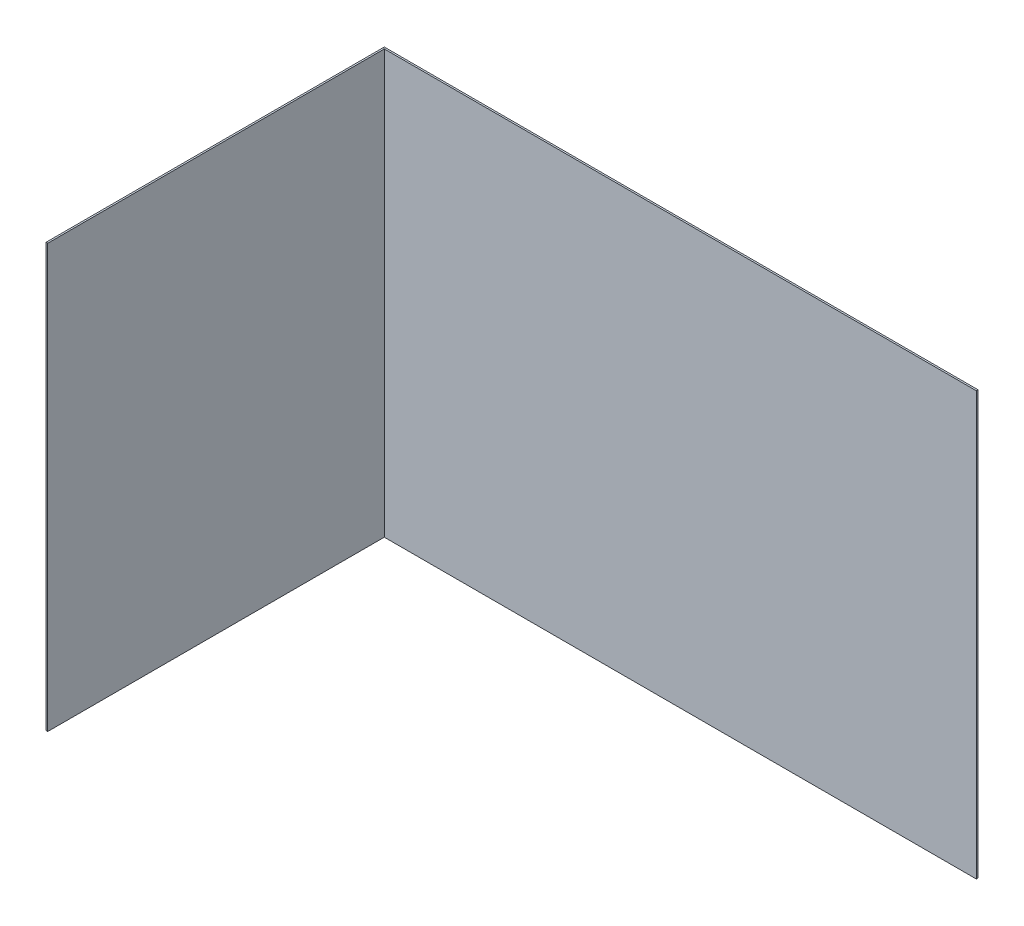
ISO-10303-21;
HEADER;
FILE_DESCRIPTION(('STEP AP214'),'2;1');
FILE_NAME('part.step','',(''),(''),'','','');
FILE_SCHEMA(('AUTOMOTIVE_DESIGN { 1 0 10303 214 1 1 1 1 }'));
ENDSEC;
DATA;
#1=APPLICATION_CONTEXT('core data for automotive mechanical design processes');
#2=APPLICATION_PROTOCOL_DEFINITION('international standard','automotive_design',2000,#1);
#3=PRODUCT_CONTEXT('',#1,'mechanical');
#4=PRODUCT('Part','Part','',(#3));
#5=PRODUCT_RELATED_PRODUCT_CATEGORY('part','',(#4));
#6=PRODUCT_DEFINITION_FORMATION('','',#4);
#7=PRODUCT_DEFINITION_CONTEXT('part definition',#1,'design');
#8=PRODUCT_DEFINITION('design','',#6,#7);
#9=PRODUCT_DEFINITION_SHAPE('','',#8);
#10=(LENGTH_UNIT() NAMED_UNIT(*) SI_UNIT(.MILLI.,.METRE.));
#11=(NAMED_UNIT(*) PLANE_ANGLE_UNIT() SI_UNIT($,.RADIAN.));
#12=(NAMED_UNIT(*) SI_UNIT($,.STERADIAN.) SOLID_ANGLE_UNIT());
#13=UNCERTAINTY_MEASURE_WITH_UNIT(LENGTH_MEASURE(1.E-05),#10,'distance_accuracy_value','');
#14=(GEOMETRIC_REPRESENTATION_CONTEXT(3) GLOBAL_UNCERTAINTY_ASSIGNED_CONTEXT((#13)) GLOBAL_UNIT_ASSIGNED_CONTEXT((#10,
#11,#12)) REPRESENTATION_CONTEXT('',''));
#15=CARTESIAN_POINT('',(0.,0.,0.));
#16=DIRECTION('',(0.,0.,1.));
#17=DIRECTION('',(1.,0.,0.));
#18=AXIS2_PLACEMENT_3D('',#15,#16,#17);
#19=CARTESIAN_POINT('',(-0.001,0.,0.));
#20=DIRECTION('',(1.,0.,0.));
#21=DIRECTION('',(0.,0.,1.));
#22=AXIS2_PLACEMENT_3D('',#19,#20,#21);
#23=PLANE('',#22);
#24=DIRECTION('',(0.,1.,0.));
#25=VECTOR('',#24,1.);
#26=CARTESIAN_POINT('',(-0.001,0.,0.2));
#27=LINE('',#26,#25);
#28=CARTESIAN_POINT('',(-0.001,0.,0.2));
#29=VERTEX_POINT('',#28);
#30=CARTESIAN_POINT('',(-0.001,0.25,0.2));
#31=VERTEX_POINT('',#30);
#32=EDGE_CURVE('E11',#29,#31,#27,.T.);
#33=ORIENTED_EDGE('',*,*,#32,.T.);
#34=DIRECTION('',(0.,0.,-1.));
#35=VECTOR('',#34,1.);
#36=CARTESIAN_POINT('',(-0.001,0.25,0.2));
#37=LINE('',#36,#35);
#38=CARTESIAN_POINT('',(-0.001,0.25,0.001));
#39=VERTEX_POINT('',#38);
#40=EDGE_CURVE('E98',#31,#39,#37,.T.);
#41=ORIENTED_EDGE('',*,*,#40,.T.);
#42=DIRECTION('',(0.,-1.,0.));
#43=VECTOR('',#42,1.);
#44=CARTESIAN_POINT('',(-0.001,0.25,0.001));
#45=LINE('',#44,#43);
#46=CARTESIAN_POINT('',(-0.001,0.,0.001));
#47=VERTEX_POINT('',#46);
#48=EDGE_CURVE('E100',#39,#47,#45,.T.);
#49=ORIENTED_EDGE('',*,*,#48,.T.);
#50=DIRECTION('',(0.,0.,1.));
#51=VECTOR('',#50,1.);
#52=CARTESIAN_POINT('',(-0.001,0.,0.));
#53=LINE('',#52,#51);
#54=EDGE_CURVE('E116',#47,#29,#53,.T.);
#55=ORIENTED_EDGE('',*,*,#54,.T.);
#56=EDGE_LOOP('',(#33,#41,#49,#55));
#57=FACE_BOUND('',#56,.T.);
#58=ADVANCED_FACE('F17',(#57),#23,.F.);
#59=CARTESIAN_POINT('',(0.,0.,0.2));
#60=DIRECTION('',(0.,0.,-1.));
#61=DIRECTION('',(0.,-1.,0.));
#62=AXIS2_PLACEMENT_3D('',#59,#60,#61);
#63=PLANE('',#62);
#64=DIRECTION('',(0.,1.,0.));
#65=VECTOR('',#64,1.);
#66=CARTESIAN_POINT('',(0.,0.,0.2));
#67=LINE('',#66,#65);
#68=CARTESIAN_POINT('',(0.,0.,0.2));
#69=VERTEX_POINT('',#68);
#70=CARTESIAN_POINT('',(0.,0.25,0.2));
#71=VERTEX_POINT('',#70);
#72=EDGE_CURVE('E150',#69,#71,#67,.T.);
#73=ORIENTED_EDGE('',*,*,#72,.T.);
#74=DIRECTION('',(-1.,0.,0.));
#75=VECTOR('',#74,1.);
#76=CARTESIAN_POINT('',(0.,0.25,0.2));
#77=LINE('',#76,#75);
#78=EDGE_CURVE('E26',#71,#31,#77,.T.);
#79=ORIENTED_EDGE('',*,*,#78,.T.);
#80=ORIENTED_EDGE('',*,*,#32,.F.);
#81=DIRECTION('',(-1.,0.,0.));
#82=VECTOR('',#81,1.);
#83=CARTESIAN_POINT('',(0.,0.,0.2));
#84=LINE('',#83,#82);
#85=EDGE_CURVE('E154',#69,#29,#84,.T.);
#86=ORIENTED_EDGE('',*,*,#85,.F.);
#87=EDGE_LOOP('',(#73,#79,#80,#86));
#88=FACE_BOUND('',#87,.T.);
#89=ADVANCED_FACE('F19',(#88),#63,.F.);
#90=CARTESIAN_POINT('',(0.,0.25,0.2));
#91=DIRECTION('',(0.,-1.,0.));
#92=DIRECTION('',(0.,0.,-1.));
#93=AXIS2_PLACEMENT_3D('',#90,#91,#92);
#94=PLANE('',#93);
#95=DIRECTION('',(-1.,0.,0.));
#96=VECTOR('',#95,1.);
#97=CARTESIAN_POINT('',(0.35,0.25,0.001));
#98=LINE('',#97,#96);
#99=CARTESIAN_POINT('',(0.,0.25,0.001));
#100=VERTEX_POINT('',#99);
#101=EDGE_CURVE('E119',#100,#39,#98,.T.);
#102=ORIENTED_EDGE('',*,*,#101,.T.);
#103=ORIENTED_EDGE('',*,*,#40,.F.);
#104=ORIENTED_EDGE('',*,*,#78,.F.);
#105=DIRECTION('',(0.,0.,-1.));
#106=VECTOR('',#105,1.);
#107=CARTESIAN_POINT('',(0.,0.25,0.2));
#108=LINE('',#107,#106);
#109=EDGE_CURVE('E122',#71,#100,#108,.T.);
#110=ORIENTED_EDGE('',*,*,#109,.T.);
#111=EDGE_LOOP('',(#102,#103,#104,#110));
#112=FACE_BOUND('',#111,.T.);
#113=ADVANCED_FACE('F120',(#112),#94,.F.);
#114=CARTESIAN_POINT('',(-0.001,0.25,0.));
#115=DIRECTION('',(1.,0.,0.));
#116=DIRECTION('',(0.,1.,0.));
#117=AXIS2_PLACEMENT_3D('',#114,#115,#116);
#118=PLANE('',#117);
#119=DIRECTION('',(0.,-1.,0.));
#120=VECTOR('',#119,1.);
#121=CARTESIAN_POINT('',(-0.001,0.25,0.));
#122=LINE('',#121,#120);
#123=CARTESIAN_POINT('',(-0.001,0.25,0.));
#124=VERTEX_POINT('',#123);
#125=CARTESIAN_POINT('',(-0.001,0.,0.));
#126=VERTEX_POINT('',#125);
#127=EDGE_CURVE('E127',#124,#126,#122,.T.);
#128=ORIENTED_EDGE('',*,*,#127,.T.);
#129=DIRECTION('',(0.,0.,1.));
#130=VECTOR('',#129,1.);
#131=CARTESIAN_POINT('',(-0.001,0.,0.));
#132=LINE('',#131,#130);
#133=EDGE_CURVE('E113',#126,#47,#132,.T.);
#134=ORIENTED_EDGE('',*,*,#133,.T.);
#135=ORIENTED_EDGE('',*,*,#48,.F.);
#136=DIRECTION('',(0.,0.,1.));
#137=VECTOR('',#136,1.);
#138=CARTESIAN_POINT('',(-0.001,0.25,0.));
#139=LINE('',#138,#137);
#140=EDGE_CURVE('E110',#124,#39,#139,.T.);
#141=ORIENTED_EDGE('',*,*,#140,.F.);
#142=EDGE_LOOP('',(#128,#134,#135,#141));
#143=FACE_BOUND('',#142,.T.);
#144=ADVANCED_FACE('F108',(#143),#118,.F.);
#145=CARTESIAN_POINT('',(0.,0.,0.));
#146=DIRECTION('',(0.,1.,0.));
#147=DIRECTION('',(1.,0.,0.));
#148=AXIS2_PLACEMENT_3D('',#145,#146,#147);
#149=PLANE('',#148);
#150=ORIENTED_EDGE('',*,*,#85,.T.);
#151=ORIENTED_EDGE('',*,*,#54,.F.);
#152=DIRECTION('',(1.,0.,0.));
#153=VECTOR('',#152,1.);
#154=CARTESIAN_POINT('',(-0.001,0.,0.001));
#155=LINE('',#154,#153);
#156=CARTESIAN_POINT('',(0.,0.,0.001));
#157=VERTEX_POINT('',#156);
#158=EDGE_CURVE('E173',#47,#157,#155,.T.);
#159=ORIENTED_EDGE('',*,*,#158,.T.);
#160=DIRECTION('',(0.,0.,1.));
#161=VECTOR('',#160,1.);
#162=CARTESIAN_POINT('',(0.,0.,0.));
#163=LINE('',#162,#161);
#164=EDGE_CURVE('E144',#157,#69,#163,.T.);
#165=ORIENTED_EDGE('',*,*,#164,.T.);
#166=EDGE_LOOP('',(#150,#151,#159,#165));
#167=FACE_BOUND('',#166,.T.);
#168=ADVANCED_FACE('F302',(#167),#149,.F.);
#169=CARTESIAN_POINT('',(0.,0.,0.));
#170=DIRECTION('',(1.,0.,0.));
#171=DIRECTION('',(0.,0.,1.));
#172=AXIS2_PLACEMENT_3D('',#169,#170,#171);
#173=PLANE('',#172);
#174=ORIENTED_EDGE('',*,*,#164,.F.);
#175=DIRECTION('',(0.,-1.,0.));
#176=VECTOR('',#175,1.);
#177=CARTESIAN_POINT('',(0.,0.,0.001));
#178=LINE('',#177,#176);
#179=EDGE_CURVE('E167',#100,#157,#178,.T.);
#180=ORIENTED_EDGE('',*,*,#179,.F.);
#181=ORIENTED_EDGE('',*,*,#109,.F.);
#182=ORIENTED_EDGE('',*,*,#72,.F.);
#183=EDGE_LOOP('',(#174,#180,#181,#182));
#184=FACE_BOUND('',#183,.T.);
#185=ADVANCED_FACE('F165',(#184),#173,.T.);
#186=CARTESIAN_POINT('',(-0.001,0.,0.));
#187=DIRECTION('',(0.,0.,-1.));
#188=DIRECTION('',(0.,-1.,0.));
#189=AXIS2_PLACEMENT_3D('',#186,#187,#188);
#190=PLANE('',#189);
#191=DIRECTION('',(0.,-1.,0.));
#192=VECTOR('',#191,1.);
#193=CARTESIAN_POINT('',(0.,0.25,0.));
#194=LINE('',#193,#192);
#195=CARTESIAN_POINT('',(0.,0.25,0.));
#196=VERTEX_POINT('',#195);
#197=CARTESIAN_POINT('',(0.,0.,0.));
#198=VERTEX_POINT('',#197);
#199=EDGE_CURVE('E174',#196,#198,#194,.T.);
#200=ORIENTED_EDGE('',*,*,#199,.T.);
#201=DIRECTION('',(-1.,0.,0.));
#202=VECTOR('',#201,1.);
#203=CARTESIAN_POINT('',(0.,0.,0.));
#204=LINE('',#203,#202);
#205=EDGE_CURVE('E137',#198,#126,#204,.T.);
#206=ORIENTED_EDGE('',*,*,#205,.T.);
#207=ORIENTED_EDGE('',*,*,#127,.F.);
#208=DIRECTION('',(-1.,0.,0.));
#209=VECTOR('',#208,1.);
#210=CARTESIAN_POINT('',(0.,0.25,0.));
#211=LINE('',#210,#209);
#212=EDGE_CURVE('E130',#196,#124,#211,.T.);
#213=ORIENTED_EDGE('',*,*,#212,.F.);
#214=EDGE_LOOP('',(#200,#206,#207,#213));
#215=FACE_BOUND('',#214,.T.);
#216=ADVANCED_FACE('F339',(#215),#190,.T.);
#217=CARTESIAN_POINT('',(0.,0.25,0.2));
#218=DIRECTION('',(0.,-1.,0.));
#219=DIRECTION('',(0.,0.,-1.));
#220=AXIS2_PLACEMENT_3D('',#217,#218,#219);
#221=PLANE('',#220);
#222=ORIENTED_EDGE('',*,*,#212,.T.);
#223=ORIENTED_EDGE('',*,*,#140,.T.);
#224=ORIENTED_EDGE('',*,*,#101,.F.);
#225=DIRECTION('',(0.,0.,-1.));
#226=VECTOR('',#225,1.);
#227=CARTESIAN_POINT('',(0.,0.25,0.2));
#228=LINE('',#227,#226);
#229=EDGE_CURVE('E187',#100,#196,#228,.T.);
#230=ORIENTED_EDGE('',*,*,#229,.T.);
#231=EDGE_LOOP('',(#222,#223,#224,#230));
#232=FACE_BOUND('',#231,.T.);
#233=ADVANCED_FACE('F129',(#232),#221,.F.);
#234=CARTESIAN_POINT('',(0.,0.,0.));
#235=DIRECTION('',(0.,1.,0.));
#236=DIRECTION('',(1.,0.,0.));
#237=AXIS2_PLACEMENT_3D('',#234,#235,#236);
#238=PLANE('',#237);
#239=ORIENTED_EDGE('',*,*,#158,.F.);
#240=ORIENTED_EDGE('',*,*,#133,.F.);
#241=ORIENTED_EDGE('',*,*,#205,.F.);
#242=DIRECTION('',(0.,0.,1.));
#243=VECTOR('',#242,1.);
#244=CARTESIAN_POINT('',(0.,0.,0.));
#245=LINE('',#244,#243);
#246=EDGE_CURVE('E197',#198,#157,#245,.T.);
#247=ORIENTED_EDGE('',*,*,#246,.T.);
#248=EDGE_LOOP('',(#239,#240,#241,#247));
#249=FACE_BOUND('',#248,.T.);
#250=ADVANCED_FACE('F323',(#249),#238,.F.);
#251=CARTESIAN_POINT('',(-0.001,0.,0.001));
#252=DIRECTION('',(0.,0.,-1.));
#253=DIRECTION('',(0.,-1.,0.));
#254=AXIS2_PLACEMENT_3D('',#251,#252,#253);
#255=PLANE('',#254);
#256=DIRECTION('',(0.,1.,0.));
#257=VECTOR('',#256,1.);
#258=CARTESIAN_POINT('',(0.35,0.,0.001));
#259=LINE('',#258,#257);
#260=CARTESIAN_POINT('',(0.35,0.,0.001));
#261=VERTEX_POINT('',#260);
#262=CARTESIAN_POINT('',(0.35,0.25,0.001));
#263=VERTEX_POINT('',#262);
#264=EDGE_CURVE('E181',#261,#263,#259,.T.);
#265=ORIENTED_EDGE('',*,*,#264,.T.);
#266=DIRECTION('',(-1.,0.,0.));
#267=VECTOR('',#266,1.);
#268=CARTESIAN_POINT('',(0.35,0.25,0.001));
#269=LINE('',#268,#267);
#270=EDGE_CURVE('E177',#263,#100,#269,.T.);
#271=ORIENTED_EDGE('',*,*,#270,.T.);
#272=ORIENTED_EDGE('',*,*,#179,.T.);
#273=DIRECTION('',(1.,0.,0.));
#274=VECTOR('',#273,1.);
#275=CARTESIAN_POINT('',(-0.001,0.,0.001));
#276=LINE('',#275,#274);
#277=EDGE_CURVE('E223',#157,#261,#276,.T.);
#278=ORIENTED_EDGE('',*,*,#277,.T.);
#279=EDGE_LOOP('',(#265,#271,#272,#278));
#280=FACE_BOUND('',#279,.T.);
#281=ADVANCED_FACE('F179',(#280),#255,.F.);
#282=CARTESIAN_POINT('',(-0.001,0.,0.));
#283=DIRECTION('',(0.,0.,-1.));
#284=DIRECTION('',(0.,-1.,0.));
#285=AXIS2_PLACEMENT_3D('',#282,#283,#284);
#286=PLANE('',#285);
#287=DIRECTION('',(1.,0.,0.));
#288=VECTOR('',#287,1.);
#289=CARTESIAN_POINT('',(-0.001,0.,0.));
#290=LINE('',#289,#288);
#291=CARTESIAN_POINT('',(0.35,0.,0.));
#292=VERTEX_POINT('',#291);
#293=EDGE_CURVE('E192',#198,#292,#290,.T.);
#294=ORIENTED_EDGE('',*,*,#293,.F.);
#295=ORIENTED_EDGE('',*,*,#199,.F.);
#296=DIRECTION('',(-1.,0.,0.));
#297=VECTOR('',#296,1.);
#298=CARTESIAN_POINT('',(0.35,0.25,0.));
#299=LINE('',#298,#297);
#300=CARTESIAN_POINT('',(0.35,0.25,0.));
#301=VERTEX_POINT('',#300);
#302=EDGE_CURVE('E186',#301,#196,#299,.T.);
#303=ORIENTED_EDGE('',*,*,#302,.F.);
#304=DIRECTION('',(0.,1.,0.));
#305=VECTOR('',#304,1.);
#306=CARTESIAN_POINT('',(0.35,0.,0.));
#307=LINE('',#306,#305);
#308=EDGE_CURVE('E212',#292,#301,#307,.T.);
#309=ORIENTED_EDGE('',*,*,#308,.F.);
#310=EDGE_LOOP('',(#294,#295,#303,#309));
#311=FACE_BOUND('',#310,.T.);
#312=ADVANCED_FACE('F281',(#311),#286,.T.);
#313=CARTESIAN_POINT('',(0.35,0.25,0.));
#314=DIRECTION('',(0.,-1.,0.));
#315=DIRECTION('',(0.,0.,-1.));
#316=AXIS2_PLACEMENT_3D('',#313,#314,#315);
#317=PLANE('',#316);
#318=ORIENTED_EDGE('',*,*,#229,.F.);
#319=ORIENTED_EDGE('',*,*,#270,.F.);
#320=DIRECTION('',(0.,0.,1.));
#321=VECTOR('',#320,1.);
#322=CARTESIAN_POINT('',(0.35,0.25,0.));
#323=LINE('',#322,#321);
#324=EDGE_CURVE('E216',#301,#263,#323,.T.);
#325=ORIENTED_EDGE('',*,*,#324,.F.);
#326=ORIENTED_EDGE('',*,*,#302,.T.);
#327=EDGE_LOOP('',(#318,#319,#325,#326));
#328=FACE_BOUND('',#327,.T.);
#329=ADVANCED_FACE('F190',(#328),#317,.F.);
#330=CARTESIAN_POINT('',(-0.001,0.,0.));
#331=DIRECTION('',(0.,1.,0.));
#332=DIRECTION('',(1.,0.,0.));
#333=AXIS2_PLACEMENT_3D('',#330,#331,#332);
#334=PLANE('',#333);
#335=DIRECTION('',(0.,0.,1.));
#336=VECTOR('',#335,1.);
#337=CARTESIAN_POINT('',(0.35,0.,0.));
#338=LINE('',#337,#336);
#339=EDGE_CURVE('E219',#292,#261,#338,.T.);
#340=ORIENTED_EDGE('',*,*,#339,.T.);
#341=ORIENTED_EDGE('',*,*,#277,.F.);
#342=ORIENTED_EDGE('',*,*,#246,.F.);
#343=ORIENTED_EDGE('',*,*,#293,.T.);
#344=EDGE_LOOP('',(#340,#341,#342,#343));
#345=FACE_BOUND('',#344,.T.);
#346=ADVANCED_FACE('F280',(#345),#334,.F.);
#347=CARTESIAN_POINT('',(0.35,0.,0.));
#348=DIRECTION('',(-1.,0.,0.));
#349=DIRECTION('',(0.,0.,1.));
#350=AXIS2_PLACEMENT_3D('',#347,#348,#349);
#351=PLANE('',#350);
#352=ORIENTED_EDGE('',*,*,#308,.T.);
#353=ORIENTED_EDGE('',*,*,#324,.T.);
#354=ORIENTED_EDGE('',*,*,#264,.F.);
#355=ORIENTED_EDGE('',*,*,#339,.F.);
#356=EDGE_LOOP('',(#352,#353,#354,#355));
#357=FACE_BOUND('',#356,.T.);
#358=ADVANCED_FACE('F287',(#357),#351,.F.);
#359=CLOSED_SHELL('',(#58,#89,#113,#144,#168,#185,#216,#233,#250,#281,#312,#329,#346,#358));
#360=MANIFOLD_SOLID_BREP('B1',#359);
#361=ADVANCED_BREP_SHAPE_REPRESENTATION('',(#18,#360),#14);
#362=SHAPE_DEFINITION_REPRESENTATION(#9,#361);
ENDSEC;
END-ISO-10303-21;
